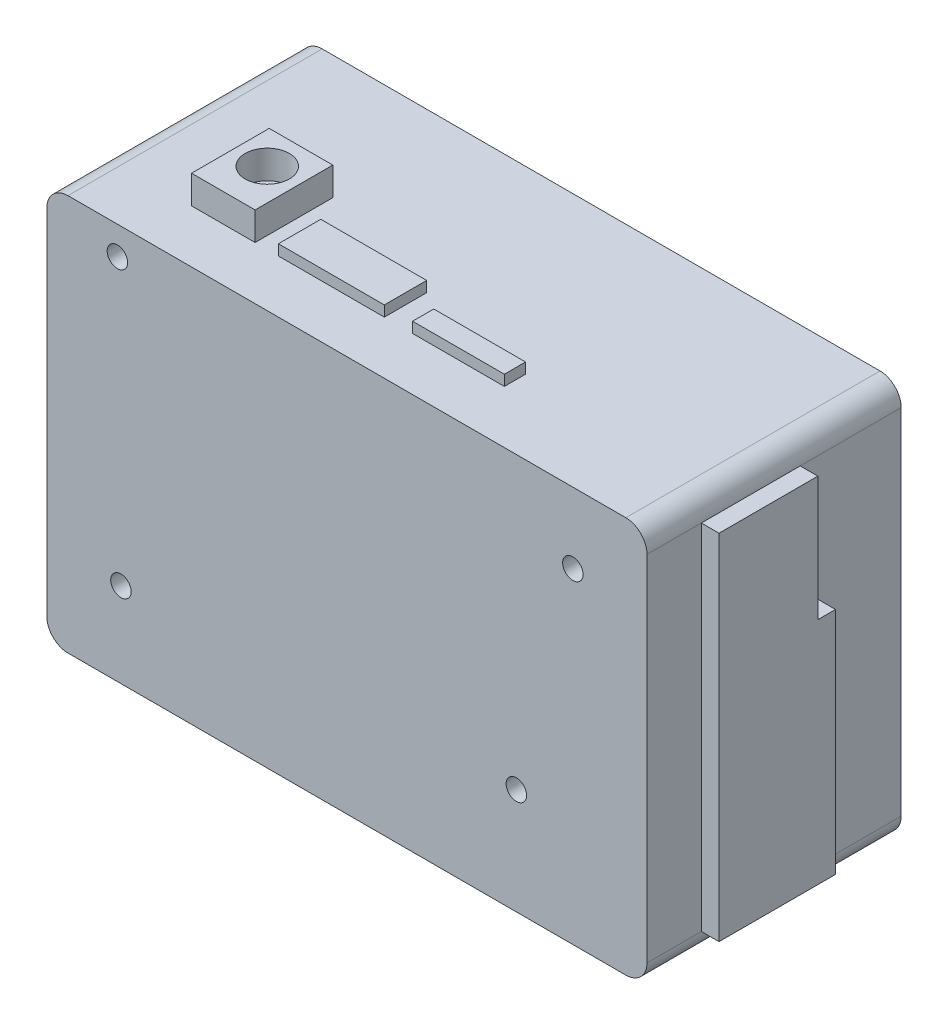
ISO-10303-21;
HEADER;
FILE_DESCRIPTION(('STEP AP214'),'2;1');
FILE_NAME('part.step','',(''),(''),'','','');
FILE_SCHEMA(('AUTOMOTIVE_DESIGN { 1 0 10303 214 1 1 1 1 }'));
ENDSEC;
DATA;
#1=APPLICATION_CONTEXT('core data for automotive mechanical design processes');
#2=APPLICATION_PROTOCOL_DEFINITION('international standard','automotive_design',2000,#1);
#3=PRODUCT_CONTEXT('',#1,'mechanical');
#4=PRODUCT('Part','Part','',(#3));
#5=PRODUCT_RELATED_PRODUCT_CATEGORY('part','',(#4));
#6=PRODUCT_DEFINITION_FORMATION('','',#4);
#7=PRODUCT_DEFINITION_CONTEXT('part definition',#1,'design');
#8=PRODUCT_DEFINITION('design','',#6,#7);
#9=PRODUCT_DEFINITION_SHAPE('','',#8);
#10=(LENGTH_UNIT() NAMED_UNIT(*) SI_UNIT(.MILLI.,.METRE.));
#11=(NAMED_UNIT(*) PLANE_ANGLE_UNIT() SI_UNIT($,.RADIAN.));
#12=(NAMED_UNIT(*) SI_UNIT($,.STERADIAN.) SOLID_ANGLE_UNIT());
#13=UNCERTAINTY_MEASURE_WITH_UNIT(LENGTH_MEASURE(1.E-05),#10,'distance_accuracy_value','');
#14=(GEOMETRIC_REPRESENTATION_CONTEXT(3) GLOBAL_UNCERTAINTY_ASSIGNED_CONTEXT((#13)) GLOBAL_UNIT_ASSIGNED_CONTEXT((#10,
#11,#12)) REPRESENTATION_CONTEXT('',''));
#15=CARTESIAN_POINT('',(0.,0.,0.));
#16=DIRECTION('',(0.,0.,1.));
#17=DIRECTION('',(1.,0.,0.));
#18=AXIS2_PLACEMENT_3D('',#15,#16,#17);
#19=CARTESIAN_POINT('',(42.5,28.05,36.));
#20=DIRECTION('',(0.,-1.,0.));
#21=DIRECTION('',(1.,0.,0.));
#22=AXIS2_PLACEMENT_3D('',#19,#20,#21);
#23=PLANE('',#22);
#24=DIRECTION('',(0.,0.,1.));
#25=VECTOR('',#24,1.);
#26=CARTESIAN_POINT('',(-17.2,28.05,22.5));
#27=LINE('',#26,#25);
#28=CARTESIAN_POINT('',(-17.2,28.05,22.5));
#29=VERTEX_POINT('',#28);
#30=CARTESIAN_POINT('',(-17.2,28.05,28.5));
#31=VERTEX_POINT('',#30);
#32=EDGE_CURVE('E230',#29,#31,#27,.T.);
#33=ORIENTED_EDGE('',*,*,#32,.F.);
#34=DIRECTION('',(-1.,0.,0.));
#35=VECTOR('',#34,1.);
#36=CARTESIAN_POINT('',(-17.2,28.05,22.5));
#37=LINE('',#36,#35);
#38=CARTESIAN_POINT('',(-2.19999999999998,28.05,22.5));
#39=VERTEX_POINT('',#38);
#40=EDGE_CURVE('E243',#39,#29,#37,.T.);
#41=ORIENTED_EDGE('',*,*,#40,.F.);
#42=DIRECTION('',(0.,0.,-1.));
#43=VECTOR('',#42,1.);
#44=CARTESIAN_POINT('',(-2.19999999999997,28.05,22.5));
#45=LINE('',#44,#43);
#46=CARTESIAN_POINT('',(-2.19999999999997,28.05,28.5));
#47=VERTEX_POINT('',#46);
#48=EDGE_CURVE('E252',#47,#39,#45,.T.);
#49=ORIENTED_EDGE('',*,*,#48,.F.);
#50=DIRECTION('',(1.,0.,0.));
#51=VECTOR('',#50,1.);
#52=CARTESIAN_POINT('',(-17.2,28.05,28.5));
#53=LINE('',#52,#51);
#54=EDGE_CURVE('E233',#31,#47,#53,.T.);
#55=ORIENTED_EDGE('',*,*,#54,.F.);
#56=EDGE_LOOP('',(#33,#41,#49,#55));
#57=FACE_BOUND('',#56,.T.);
#58=DIRECTION('',(0.,0.,1.));
#59=VECTOR('',#58,1.);
#60=CARTESIAN_POINT('',(-29.5,28.05,17.5));
#61=LINE('',#60,#59);
#62=CARTESIAN_POINT('',(-29.5,28.05,17.5));
#63=VERTEX_POINT('',#62);
#64=CARTESIAN_POINT('',(-29.5,28.05,28.5));
#65=VERTEX_POINT('',#64);
#66=EDGE_CURVE('E272',#63,#65,#61,.T.);
#67=ORIENTED_EDGE('',*,*,#66,.F.);
#68=DIRECTION('',(-1.,0.,0.));
#69=VECTOR('',#68,1.);
#70=CARTESIAN_POINT('',(-29.5,28.05,17.5));
#71=LINE('',#70,#69);
#72=CARTESIAN_POINT('',(-20.5,28.05,17.5));
#73=VERTEX_POINT('',#72);
#74=EDGE_CURVE('E279',#73,#63,#71,.T.);
#75=ORIENTED_EDGE('',*,*,#74,.F.);
#76=DIRECTION('',(0.,0.,-1.));
#77=VECTOR('',#76,1.);
#78=CARTESIAN_POINT('',(-20.5,28.05,17.5));
#79=LINE('',#78,#77);
#80=CARTESIAN_POINT('',(-20.5,28.05,28.5));
#81=VERTEX_POINT('',#80);
#82=EDGE_CURVE('E291',#81,#73,#79,.T.);
#83=ORIENTED_EDGE('',*,*,#82,.F.);
#84=DIRECTION('',(1.,0.,0.));
#85=VECTOR('',#84,1.);
#86=CARTESIAN_POINT('',(-29.5,28.05,28.5));
#87=LINE('',#86,#85);
#88=EDGE_CURVE('E288',#65,#81,#87,.T.);
#89=ORIENTED_EDGE('',*,*,#88,.F.);
#90=EDGE_LOOP('',(#67,#75,#83,#89));
#91=FACE_BOUND('',#90,.T.);
#92=DIRECTION('',(-1.,0.,0.));
#93=VECTOR('',#92,1.);
#94=CARTESIAN_POINT('',(42.5,28.05,36.));
#95=LINE('',#94,#93);
#96=CARTESIAN_POINT('',(39.5,28.05,36.));
#97=VERTEX_POINT('',#96);
#98=CARTESIAN_POINT('',(-39.5,28.05,36.));
#99=VERTEX_POINT('',#98);
#100=EDGE_CURVE('E388',#97,#99,#95,.T.);
#101=ORIENTED_EDGE('',*,*,#100,.F.);
#102=DIRECTION('',(0.,0.,-1.));
#103=VECTOR('',#102,1.);
#104=CARTESIAN_POINT('',(39.5,28.05,36.));
#105=LINE('',#104,#103);
#106=CARTESIAN_POINT('',(39.5,28.05,0.));
#107=VERTEX_POINT('',#106);
#108=EDGE_CURVE('E403',#97,#107,#105,.T.);
#109=ORIENTED_EDGE('',*,*,#108,.T.);
#110=DIRECTION('',(-1.,0.,0.));
#111=VECTOR('',#110,1.);
#112=CARTESIAN_POINT('',(42.5,28.05,0.));
#113=LINE('',#112,#111);
#114=CARTESIAN_POINT('',(-39.5,28.05,0.));
#115=VERTEX_POINT('',#114);
#116=EDGE_CURVE('E382',#107,#115,#113,.T.);
#117=ORIENTED_EDGE('',*,*,#116,.T.);
#118=DIRECTION('',(0.,0.,-1.));
#119=VECTOR('',#118,1.);
#120=CARTESIAN_POINT('',(-39.5,28.05,36.));
#121=LINE('',#120,#119);
#122=EDGE_CURVE('E391',#115,#99,#121,.F.);
#123=ORIENTED_EDGE('',*,*,#122,.T.);
#124=EDGE_LOOP('',(#101,#109,#117,#123));
#125=FACE_BOUND('',#124,.T.);
#126=DIRECTION('',(0.,0.,1.));
#127=VECTOR('',#126,1.);
#128=CARTESIAN_POINT('',(1.80000000000003,28.05,25.5));
#129=LINE('',#128,#127);
#130=CARTESIAN_POINT('',(1.80000000000003,28.05,25.5));
#131=VERTEX_POINT('',#130);
#132=CARTESIAN_POINT('',(1.80000000000002,28.05,28.5));
#133=VERTEX_POINT('',#132);
#134=EDGE_CURVE('E229',#131,#133,#129,.T.);
#135=ORIENTED_EDGE('',*,*,#134,.F.);
#136=DIRECTION('',(-1.,0.,0.));
#137=VECTOR('',#136,1.);
#138=CARTESIAN_POINT('',(1.80000000000003,28.05,25.5));
#139=LINE('',#138,#137);
#140=CARTESIAN_POINT('',(14.8,28.05,25.5));
#141=VERTEX_POINT('',#140);
#142=EDGE_CURVE('E226',#141,#131,#139,.T.);
#143=ORIENTED_EDGE('',*,*,#142,.F.);
#144=DIRECTION('',(0.,0.,-1.));
#145=VECTOR('',#144,1.);
#146=CARTESIAN_POINT('',(14.8,28.05,25.5));
#147=LINE('',#146,#145);
#148=CARTESIAN_POINT('',(14.8,28.05,28.5));
#149=VERTEX_POINT('',#148);
#150=EDGE_CURVE('E57',#149,#141,#147,.T.);
#151=ORIENTED_EDGE('',*,*,#150,.F.);
#152=DIRECTION('',(1.,0.,0.));
#153=VECTOR('',#152,1.);
#154=CARTESIAN_POINT('',(1.80000000000003,28.05,28.5));
#155=LINE('',#154,#153);
#156=EDGE_CURVE('E52',#133,#149,#155,.T.);
#157=ORIENTED_EDGE('',*,*,#156,.F.);
#158=EDGE_LOOP('',(#135,#143,#151,#157));
#159=FACE_BOUND('',#158,.T.);
#160=ADVANCED_FACE('F36',(#57,#91,#125,#159),#23,.F.);
#161=CARTESIAN_POINT('',(-32.5,24.05,36.));
#162=DIRECTION('',(0.,0.,-1.));
#163=DIRECTION('',(-1.,0.,0.));
#164=AXIS2_PLACEMENT_3D('',#161,#162,#163);
#165=CYLINDRICAL_SURFACE('',#164,1.45);
#166=CARTESIAN_POINT('',(-32.5,24.05,36.));
#167=DIRECTION('',(0.,0.,1.));
#168=DIRECTION('',(1.,0.,0.));
#169=AXIS2_PLACEMENT_3D('',#166,#167,#168);
#170=CIRCLE('',#169,1.45);
#171=CARTESIAN_POINT('',(-31.05,24.05,36.));
#172=VERTEX_POINT('',#171);
#173=EDGE_CURVE('E374',#172,#172,#170,.T.);
#174=ORIENTED_EDGE('',*,*,#173,.T.);
#175=EDGE_LOOP('',(#174));
#176=FACE_BOUND('',#175,.T.);
#177=CARTESIAN_POINT('',(-32.5,24.05,2.5));
#178=DIRECTION('',(0.,0.,-1.));
#179=DIRECTION('',(-1.,0.,0.));
#180=AXIS2_PLACEMENT_3D('',#177,#178,#179);
#181=CIRCLE('',#180,1.45);
#182=CARTESIAN_POINT('',(-33.95,24.05,2.5));
#183=VERTEX_POINT('',#182);
#184=EDGE_CURVE('E313',#183,#183,#181,.T.);
#185=ORIENTED_EDGE('',*,*,#184,.T.);
#186=EDGE_LOOP('',(#185));
#187=FACE_BOUND('',#186,.T.);
#188=ADVANCED_FACE('F504',(#176,#187),#165,.F.);
#189=CARTESIAN_POINT('',(-32.,-16.05,36.));
#190=DIRECTION('',(0.,0.,-1.));
#191=DIRECTION('',(-1.,0.,0.));
#192=AXIS2_PLACEMENT_3D('',#189,#190,#191);
#193=CYLINDRICAL_SURFACE('',#192,1.45);
#194=CARTESIAN_POINT('',(-32.,-16.05,36.));
#195=DIRECTION('',(0.,0.,1.));
#196=DIRECTION('',(1.,0.,0.));
#197=AXIS2_PLACEMENT_3D('',#194,#195,#196);
#198=CIRCLE('',#197,1.45);
#199=CARTESIAN_POINT('',(-30.55,-16.05,36.));
#200=VERTEX_POINT('',#199);
#201=EDGE_CURVE('E371',#200,#200,#198,.T.);
#202=ORIENTED_EDGE('',*,*,#201,.T.);
#203=EDGE_LOOP('',(#202));
#204=FACE_BOUND('',#203,.T.);
#205=CARTESIAN_POINT('',(-32.,-16.05,2.5));
#206=DIRECTION('',(0.,0.,-1.));
#207=DIRECTION('',(-1.,0.,0.));
#208=AXIS2_PLACEMENT_3D('',#205,#206,#207);
#209=CIRCLE('',#208,1.45);
#210=CARTESIAN_POINT('',(-33.45,-16.05,2.5));
#211=VERTEX_POINT('',#210);
#212=EDGE_CURVE('E310',#211,#211,#209,.T.);
#213=ORIENTED_EDGE('',*,*,#212,.T.);
#214=EDGE_LOOP('',(#213));
#215=FACE_BOUND('',#214,.T.);
#216=ADVANCED_FACE('F511',(#204,#215),#193,.F.);
#217=CARTESIAN_POINT('',(32.,18.05,36.));
#218=DIRECTION('',(0.,0.,-1.));
#219=DIRECTION('',(-1.,0.,0.));
#220=AXIS2_PLACEMENT_3D('',#217,#218,#219);
#221=CYLINDRICAL_SURFACE('',#220,1.45);
#222=CARTESIAN_POINT('',(32.,18.05,36.));
#223=DIRECTION('',(0.,0.,1.));
#224=DIRECTION('',(1.,0.,0.));
#225=AXIS2_PLACEMENT_3D('',#222,#223,#224);
#226=CIRCLE('',#225,1.45);
#227=CARTESIAN_POINT('',(33.45,18.05,36.));
#228=VERTEX_POINT('',#227);
#229=EDGE_CURVE('E368',#228,#228,#226,.T.);
#230=ORIENTED_EDGE('',*,*,#229,.T.);
#231=EDGE_LOOP('',(#230));
#232=FACE_BOUND('',#231,.T.);
#233=CARTESIAN_POINT('',(32.,18.05,2.5));
#234=DIRECTION('',(0.,0.,-1.));
#235=DIRECTION('',(-1.,0.,0.));
#236=AXIS2_PLACEMENT_3D('',#233,#234,#235);
#237=CIRCLE('',#236,1.45);
#238=CARTESIAN_POINT('',(30.55,18.05,2.5));
#239=VERTEX_POINT('',#238);
#240=EDGE_CURVE('E307',#239,#239,#237,.T.);
#241=ORIENTED_EDGE('',*,*,#240,.T.);
#242=EDGE_LOOP('',(#241));
#243=FACE_BOUND('',#242,.T.);
#244=ADVANCED_FACE('F583',(#232,#243),#221,.F.);
#245=CARTESIAN_POINT('',(24.,-13.05,36.));
#246=DIRECTION('',(0.,0.,-1.));
#247=DIRECTION('',(-1.,0.,0.));
#248=AXIS2_PLACEMENT_3D('',#245,#246,#247);
#249=CYLINDRICAL_SURFACE('',#248,1.45);
#250=CARTESIAN_POINT('',(24.,-13.05,36.));
#251=DIRECTION('',(0.,0.,1.));
#252=DIRECTION('',(1.,0.,0.));
#253=AXIS2_PLACEMENT_3D('',#250,#251,#252);
#254=CIRCLE('',#253,1.45);
#255=CARTESIAN_POINT('',(25.45,-13.05,36.));
#256=VERTEX_POINT('',#255);
#257=EDGE_CURVE('E365',#256,#256,#254,.T.);
#258=ORIENTED_EDGE('',*,*,#257,.T.);
#259=EDGE_LOOP('',(#258));
#260=FACE_BOUND('',#259,.T.);
#261=CARTESIAN_POINT('',(24.,-13.05,2.5));
#262=DIRECTION('',(0.,0.,-1.));
#263=DIRECTION('',(-1.,0.,0.));
#264=AXIS2_PLACEMENT_3D('',#261,#262,#263);
#265=CIRCLE('',#264,1.45);
#266=CARTESIAN_POINT('',(22.55,-13.05,2.5));
#267=VERTEX_POINT('',#266);
#268=EDGE_CURVE('E40',#267,#267,#265,.T.);
#269=ORIENTED_EDGE('',*,*,#268,.T.);
#270=EDGE_LOOP('',(#269));
#271=FACE_BOUND('',#270,.T.);
#272=ADVANCED_FACE('F580',(#260,#271),#249,.F.);
#273=CARTESIAN_POINT('',(42.5,-28.05,36.));
#274=DIRECTION('',(-1.,0.,0.));
#275=DIRECTION('',(0.,0.,1.));
#276=AXIS2_PLACEMENT_3D('',#273,#274,#275);
#277=PLANE('',#276);
#278=DIRECTION('',(0.,-1.,0.));
#279=VECTOR('',#278,1.);
#280=CARTESIAN_POINT('',(42.5,0.,28.3));
#281=LINE('',#280,#279);
#282=CARTESIAN_POINT('',(42.5,25.05,28.3));
#283=VERTEX_POINT('',#282);
#284=CARTESIAN_POINT('',(42.5,-25.05,28.3));
#285=VERTEX_POINT('',#284);
#286=EDGE_CURVE('E335',#283,#285,#281,.T.);
#287=ORIENTED_EDGE('',*,*,#286,.F.);
#288=DIRECTION('',(0.,0.,-1.));
#289=VECTOR('',#288,1.);
#290=CARTESIAN_POINT('',(42.5,25.05,36.));
#291=LINE('',#290,#289);
#292=CARTESIAN_POINT('',(42.5,25.05,36.));
#293=VERTEX_POINT('',#292);
#294=EDGE_CURVE('E418',#283,#293,#291,.F.);
#295=ORIENTED_EDGE('',*,*,#294,.T.);
#296=DIRECTION('',(0.,1.,0.));
#297=VECTOR('',#296,1.);
#298=CARTESIAN_POINT('',(42.5,-28.05,36.));
#299=LINE('',#298,#297);
#300=CARTESIAN_POINT('',(42.5,-25.05,36.));
#301=VERTEX_POINT('',#300);
#302=EDGE_CURVE('E385',#301,#293,#299,.T.);
#303=ORIENTED_EDGE('',*,*,#302,.F.);
#304=DIRECTION('',(0.,0.,-1.));
#305=VECTOR('',#304,1.);
#306=CARTESIAN_POINT('',(42.5,-25.05,36.));
#307=LINE('',#306,#305);
#308=EDGE_CURVE('E415',#301,#285,#307,.T.);
#309=ORIENTED_EDGE('',*,*,#308,.T.);
#310=EDGE_LOOP('',(#287,#295,#303,#309));
#311=FACE_BOUND('',#310,.T.);
#312=ADVANCED_FACE('F466',(#311),#277,.F.);
#313=DIRECTION('',(0.,1.,0.));
#314=VECTOR('',#313,1.);
#315=CARTESIAN_POINT('',(42.5,0.,11.8));
#316=LINE('',#315,#314);
#317=CARTESIAN_POINT('',(42.5,-25.05,11.8));
#318=VERTEX_POINT('',#317);
#319=CARTESIAN_POINT('',(42.5,7.44999999999999,11.8));
#320=VERTEX_POINT('',#319);
#321=EDGE_CURVE('E341',#318,#320,#316,.T.);
#322=ORIENTED_EDGE('',*,*,#321,.F.);
#323=CARTESIAN_POINT('',(42.5,-25.05,0.));
#324=VERTEX_POINT('',#323);
#325=EDGE_CURVE('E414',#318,#324,#307,.T.);
#326=ORIENTED_EDGE('',*,*,#325,.T.);
#327=DIRECTION('',(0.,1.,0.));
#328=VECTOR('',#327,1.);
#329=CARTESIAN_POINT('',(42.5,-28.05,0.));
#330=LINE('',#329,#328);
#331=CARTESIAN_POINT('',(42.5,25.05,0.));
#332=VERTEX_POINT('',#331);
#333=EDGE_CURVE('E397',#324,#332,#330,.T.);
#334=ORIENTED_EDGE('',*,*,#333,.T.);
#335=CARTESIAN_POINT('',(42.5,25.05,14.3));
#336=VERTEX_POINT('',#335);
#337=EDGE_CURVE('E419',#332,#336,#291,.F.);
#338=ORIENTED_EDGE('',*,*,#337,.T.);
#339=DIRECTION('',(0.,-1.,0.));
#340=VECTOR('',#339,1.);
#341=CARTESIAN_POINT('',(42.5,0.,14.3));
#342=LINE('',#341,#340);
#343=CARTESIAN_POINT('',(42.5,7.44999999999999,14.3));
#344=VERTEX_POINT('',#343);
#345=EDGE_CURVE('E321',#336,#344,#342,.T.);
#346=ORIENTED_EDGE('',*,*,#345,.T.);
#347=DIRECTION('',(0.,0.,1.));
#348=VECTOR('',#347,1.);
#349=CARTESIAN_POINT('',(42.5,7.44999999999999,0.));
#350=LINE('',#349,#348);
#351=EDGE_CURVE('E344',#320,#344,#350,.T.);
#352=ORIENTED_EDGE('',*,*,#351,.F.);
#353=EDGE_LOOP('',(#322,#326,#334,#338,#346,#352));
#354=FACE_BOUND('',#353,.T.);
#355=ADVANCED_FACE('F491',(#354),#277,.F.);
#356=CARTESIAN_POINT('',(0.,0.,36.));
#357=DIRECTION('',(0.,0.,1.));
#358=DIRECTION('',(1.,0.,0.));
#359=AXIS2_PLACEMENT_3D('',#356,#357,#358);
#360=PLANE('',#359);
#361=ORIENTED_EDGE('',*,*,#229,.F.);
#362=EDGE_LOOP('',(#361));
#363=FACE_BOUND('',#362,.T.);
#364=ORIENTED_EDGE('',*,*,#173,.F.);
#365=EDGE_LOOP('',(#364));
#366=FACE_BOUND('',#365,.T.);
#367=ORIENTED_EDGE('',*,*,#302,.T.);
#368=CARTESIAN_POINT('',(39.5,25.05,36.));
#369=DIRECTION('',(0.,0.,1.));
#370=DIRECTION('',(1.,0.,0.));
#371=AXIS2_PLACEMENT_3D('',#368,#369,#370);
#372=CIRCLE('',#371,3.);
#373=EDGE_CURVE('E428',#293,#97,#372,.T.);
#374=ORIENTED_EDGE('',*,*,#373,.T.);
#375=ORIENTED_EDGE('',*,*,#100,.T.);
#376=CARTESIAN_POINT('',(-39.5,25.05,36.));
#377=DIRECTION('',(0.,0.,1.));
#378=DIRECTION('',(1.,0.,0.));
#379=AXIS2_PLACEMENT_3D('',#376,#377,#378);
#380=CIRCLE('',#379,3.);
#381=CARTESIAN_POINT('',(-42.5,25.05,36.));
#382=VERTEX_POINT('',#381);
#383=EDGE_CURVE('E422',#99,#382,#380,.T.);
#384=ORIENTED_EDGE('',*,*,#383,.T.);
#385=DIRECTION('',(0.,-1.,0.));
#386=VECTOR('',#385,1.);
#387=CARTESIAN_POINT('',(-42.5,-28.05,36.));
#388=LINE('',#387,#386);
#389=CARTESIAN_POINT('',(-42.5,-25.05,36.));
#390=VERTEX_POINT('',#389);
#391=EDGE_CURVE('E378',#382,#390,#388,.T.);
#392=ORIENTED_EDGE('',*,*,#391,.T.);
#393=CARTESIAN_POINT('',(-39.5,-25.05,36.));
#394=DIRECTION('',(0.,0.,1.));
#395=DIRECTION('',(1.,0.,0.));
#396=AXIS2_PLACEMENT_3D('',#393,#394,#395);
#397=CIRCLE('',#396,3.);
#398=CARTESIAN_POINT('',(-39.5,-28.05,36.));
#399=VERTEX_POINT('',#398);
#400=EDGE_CURVE('E424',#390,#399,#397,.T.);
#401=ORIENTED_EDGE('',*,*,#400,.T.);
#402=DIRECTION('',(1.,0.,0.));
#403=VECTOR('',#402,1.);
#404=CARTESIAN_POINT('',(42.5,-28.05,36.));
#405=LINE('',#404,#403);
#406=CARTESIAN_POINT('',(39.5,-28.05,36.));
#407=VERTEX_POINT('',#406);
#408=EDGE_CURVE('E381',#399,#407,#405,.T.);
#409=ORIENTED_EDGE('',*,*,#408,.T.);
#410=CARTESIAN_POINT('',(39.5,-25.05,36.));
#411=DIRECTION('',(0.,0.,1.));
#412=DIRECTION('',(1.,0.,0.));
#413=AXIS2_PLACEMENT_3D('',#410,#411,#412);
#414=CIRCLE('',#413,3.);
#415=EDGE_CURVE('E426',#407,#301,#414,.T.);
#416=ORIENTED_EDGE('',*,*,#415,.T.);
#417=EDGE_LOOP('',(#367,#374,#375,#384,#392,#401,#409,#416));
#418=FACE_BOUND('',#417,.T.);
#419=ORIENTED_EDGE('',*,*,#201,.F.);
#420=EDGE_LOOP('',(#419));
#421=FACE_BOUND('',#420,.T.);
#422=ORIENTED_EDGE('',*,*,#257,.F.);
#423=EDGE_LOOP('',(#422));
#424=FACE_BOUND('',#423,.T.);
#425=ADVANCED_FACE('F458',(#363,#366,#418,#421,#424),#360,.T.);
#426=CARTESIAN_POINT('',(0.,0.,0.));
#427=DIRECTION('',(0.,0.,1.));
#428=DIRECTION('',(1.,0.,0.));
#429=AXIS2_PLACEMENT_3D('',#426,#427,#428);
#430=PLANE('',#429);
#431=ORIENTED_EDGE('',*,*,#116,.F.);
#432=CARTESIAN_POINT('',(39.5,25.05,0.));
#433=DIRECTION('',(0.,0.,1.));
#434=DIRECTION('',(1.,0.,0.));
#435=AXIS2_PLACEMENT_3D('',#432,#433,#434);
#436=CIRCLE('',#435,3.);
#437=EDGE_CURVE('E412',#107,#332,#436,.F.);
#438=ORIENTED_EDGE('',*,*,#437,.T.);
#439=ORIENTED_EDGE('',*,*,#333,.F.);
#440=CARTESIAN_POINT('',(39.5,-25.05,0.));
#441=DIRECTION('',(0.,0.,1.));
#442=DIRECTION('',(1.,0.,0.));
#443=AXIS2_PLACEMENT_3D('',#440,#441,#442);
#444=CIRCLE('',#443,3.);
#445=CARTESIAN_POINT('',(39.5,-28.05,0.));
#446=VERTEX_POINT('',#445);
#447=EDGE_CURVE('E410',#324,#446,#444,.F.);
#448=ORIENTED_EDGE('',*,*,#447,.T.);
#449=DIRECTION('',(1.,0.,0.));
#450=VECTOR('',#449,1.);
#451=CARTESIAN_POINT('',(42.5,-28.05,0.));
#452=LINE('',#451,#450);
#453=CARTESIAN_POINT('',(-39.5,-28.05,0.));
#454=VERTEX_POINT('',#453);
#455=EDGE_CURVE('E394',#454,#446,#452,.T.);
#456=ORIENTED_EDGE('',*,*,#455,.F.);
#457=CARTESIAN_POINT('',(-39.5,-25.05,0.));
#458=DIRECTION('',(0.,0.,1.));
#459=DIRECTION('',(1.,0.,0.));
#460=AXIS2_PLACEMENT_3D('',#457,#458,#459);
#461=CIRCLE('',#460,3.);
#462=CARTESIAN_POINT('',(-42.5,-25.05,0.));
#463=VERTEX_POINT('',#462);
#464=EDGE_CURVE('E408',#454,#463,#461,.F.);
#465=ORIENTED_EDGE('',*,*,#464,.T.);
#466=DIRECTION('',(0.,-1.,0.));
#467=VECTOR('',#466,1.);
#468=CARTESIAN_POINT('',(-42.5,-28.05,0.));
#469=LINE('',#468,#467);
#470=CARTESIAN_POINT('',(-42.5,25.05,0.));
#471=VERTEX_POINT('',#470);
#472=EDGE_CURVE('E377',#471,#463,#469,.T.);
#473=ORIENTED_EDGE('',*,*,#472,.F.);
#474=CARTESIAN_POINT('',(-39.5,25.05,0.));
#475=DIRECTION('',(0.,0.,1.));
#476=DIRECTION('',(1.,0.,0.));
#477=AXIS2_PLACEMENT_3D('',#474,#475,#476);
#478=CIRCLE('',#477,3.);
#479=EDGE_CURVE('E406',#471,#115,#478,.F.);
#480=ORIENTED_EDGE('',*,*,#479,.T.);
#481=EDGE_LOOP('',(#431,#438,#439,#448,#456,#465,#473,#480));
#482=FACE_BOUND('',#481,.T.);
#483=ADVANCED_FACE('F446',(#482),#430,.F.);
#484=CARTESIAN_POINT('',(-42.5,-28.05,36.));
#485=DIRECTION('',(1.,0.,0.));
#486=DIRECTION('',(0.,0.,-1.));
#487=AXIS2_PLACEMENT_3D('',#484,#485,#486);
#488=PLANE('',#487);
#489=ORIENTED_EDGE('',*,*,#472,.T.);
#490=DIRECTION('',(0.,0.,-1.));
#491=VECTOR('',#490,1.);
#492=CARTESIAN_POINT('',(-42.5,-25.05,36.));
#493=LINE('',#492,#491);
#494=EDGE_CURVE('E11',#463,#390,#493,.F.);
#495=ORIENTED_EDGE('',*,*,#494,.T.);
#496=ORIENTED_EDGE('',*,*,#391,.F.);
#497=DIRECTION('',(0.,0.,-1.));
#498=VECTOR('',#497,1.);
#499=CARTESIAN_POINT('',(-42.5,25.05,36.));
#500=LINE('',#499,#498);
#501=EDGE_CURVE('E45',#382,#471,#500,.T.);
#502=ORIENTED_EDGE('',*,*,#501,.T.);
#503=EDGE_LOOP('',(#489,#495,#496,#502));
#504=FACE_BOUND('',#503,.T.);
#505=ADVANCED_FACE('F440',(#504),#488,.F.);
#506=CARTESIAN_POINT('',(42.5,-28.05,36.));
#507=DIRECTION('',(0.,1.,0.));
#508=DIRECTION('',(-1.,0.,0.));
#509=AXIS2_PLACEMENT_3D('',#506,#507,#508);
#510=PLANE('',#509);
#511=ORIENTED_EDGE('',*,*,#455,.T.);
#512=DIRECTION('',(0.,0.,-1.));
#513=VECTOR('',#512,1.);
#514=CARTESIAN_POINT('',(39.5,-28.05,36.));
#515=LINE('',#514,#513);
#516=EDGE_CURVE('E433',#446,#407,#515,.F.);
#517=ORIENTED_EDGE('',*,*,#516,.T.);
#518=ORIENTED_EDGE('',*,*,#408,.F.);
#519=DIRECTION('',(0.,0.,-1.));
#520=VECTOR('',#519,1.);
#521=CARTESIAN_POINT('',(-39.5,-28.05,36.));
#522=LINE('',#521,#520);
#523=EDGE_CURVE('E430',#399,#454,#522,.T.);
#524=ORIENTED_EDGE('',*,*,#523,.T.);
#525=EDGE_LOOP('',(#511,#517,#518,#524));
#526=FACE_BOUND('',#525,.T.);
#527=ADVANCED_FACE('F454',(#526),#510,.F.);
#528=CARTESIAN_POINT('',(39.5,25.05,36.));
#529=DIRECTION('',(0.,0.,-1.));
#530=DIRECTION('',(-1.,0.,0.));
#531=AXIS2_PLACEMENT_3D('',#528,#529,#530);
#532=CYLINDRICAL_SURFACE('',#531,3.);
#533=ORIENTED_EDGE('',*,*,#373,.F.);
#534=ORIENTED_EDGE('',*,*,#294,.F.);
#535=DIRECTION('',(0.,0.,1.));
#536=VECTOR('',#535,1.);
#537=CARTESIAN_POINT('',(42.5,25.05,0.));
#538=LINE('',#537,#536);
#539=EDGE_CURVE('E316',#336,#283,#538,.T.);
#540=ORIENTED_EDGE('',*,*,#539,.F.);
#541=ORIENTED_EDGE('',*,*,#337,.F.);
#542=ORIENTED_EDGE('',*,*,#437,.F.);
#543=ORIENTED_EDGE('',*,*,#108,.F.);
#544=EDGE_LOOP('',(#533,#534,#540,#541,#542,#543));
#545=FACE_BOUND('',#544,.T.);
#546=ADVANCED_FACE('F488',(#545),#532,.T.);
#547=CARTESIAN_POINT('',(39.5,-25.05,36.));
#548=DIRECTION('',(0.,0.,-1.));
#549=DIRECTION('',(-1.,0.,0.));
#550=AXIS2_PLACEMENT_3D('',#547,#548,#549);
#551=CYLINDRICAL_SURFACE('',#550,3.);
#552=ORIENTED_EDGE('',*,*,#415,.F.);
#553=ORIENTED_EDGE('',*,*,#516,.F.);
#554=ORIENTED_EDGE('',*,*,#447,.F.);
#555=ORIENTED_EDGE('',*,*,#325,.F.);
#556=DIRECTION('',(0.,0.,-1.));
#557=VECTOR('',#556,1.);
#558=CARTESIAN_POINT('',(42.5,-25.05,0.));
#559=LINE('',#558,#557);
#560=EDGE_CURVE('E338',#285,#318,#559,.T.);
#561=ORIENTED_EDGE('',*,*,#560,.F.);
#562=ORIENTED_EDGE('',*,*,#308,.F.);
#563=EDGE_LOOP('',(#552,#553,#554,#555,#561,#562));
#564=FACE_BOUND('',#563,.T.);
#565=ADVANCED_FACE('F463',(#564),#551,.T.);
#566=CARTESIAN_POINT('',(-39.5,-25.05,36.));
#567=DIRECTION('',(0.,0.,-1.));
#568=DIRECTION('',(-1.,0.,0.));
#569=AXIS2_PLACEMENT_3D('',#566,#567,#568);
#570=CYLINDRICAL_SURFACE('',#569,3.);
#571=ORIENTED_EDGE('',*,*,#400,.F.);
#572=ORIENTED_EDGE('',*,*,#494,.F.);
#573=ORIENTED_EDGE('',*,*,#464,.F.);
#574=ORIENTED_EDGE('',*,*,#523,.F.);
#575=EDGE_LOOP('',(#571,#572,#573,#574));
#576=FACE_BOUND('',#575,.T.);
#577=ADVANCED_FACE('F451',(#576),#570,.T.);
#578=CARTESIAN_POINT('',(-39.5,25.05,36.));
#579=DIRECTION('',(0.,0.,-1.));
#580=DIRECTION('',(-1.,0.,0.));
#581=AXIS2_PLACEMENT_3D('',#578,#579,#580);
#582=CYLINDRICAL_SURFACE('',#581,3.);
#583=ORIENTED_EDGE('',*,*,#383,.F.);
#584=ORIENTED_EDGE('',*,*,#122,.F.);
#585=ORIENTED_EDGE('',*,*,#479,.F.);
#586=ORIENTED_EDGE('',*,*,#501,.F.);
#587=EDGE_LOOP('',(#583,#584,#585,#586));
#588=FACE_BOUND('',#587,.T.);
#589=ADVANCED_FACE('F38',(#588),#582,.T.);
#590=CARTESIAN_POINT('',(45.,25.05,0.));
#591=DIRECTION('',(0.,-1.,0.));
#592=DIRECTION('',(0.,0.,-1.));
#593=AXIS2_PLACEMENT_3D('',#590,#591,#592);
#594=PLANE('',#593);
#595=ORIENTED_EDGE('',*,*,#539,.T.);
#596=DIRECTION('',(-1.,0.,0.));
#597=VECTOR('',#596,1.);
#598=CARTESIAN_POINT('',(45.,25.05,28.3));
#599=LINE('',#598,#597);
#600=CARTESIAN_POINT('',(45.,25.05,28.3));
#601=VERTEX_POINT('',#600);
#602=EDGE_CURVE('E362',#601,#283,#599,.T.);
#603=ORIENTED_EDGE('',*,*,#602,.F.);
#604=DIRECTION('',(0.,0.,1.));
#605=VECTOR('',#604,1.);
#606=CARTESIAN_POINT('',(45.,25.05,0.));
#607=LINE('',#606,#605);
#608=CARTESIAN_POINT('',(45.,25.05,14.3));
#609=VERTEX_POINT('',#608);
#610=EDGE_CURVE('E317',#609,#601,#607,.T.);
#611=ORIENTED_EDGE('',*,*,#610,.F.);
#612=DIRECTION('',(-1.,0.,0.));
#613=VECTOR('',#612,1.);
#614=CARTESIAN_POINT('',(45.,25.05,14.3));
#615=LINE('',#614,#613);
#616=EDGE_CURVE('E332',#609,#336,#615,.T.);
#617=ORIENTED_EDGE('',*,*,#616,.T.);
#618=EDGE_LOOP('',(#595,#603,#611,#617));
#619=FACE_BOUND('',#618,.T.);
#620=ADVANCED_FACE('F483',(#619),#594,.F.);
#621=CARTESIAN_POINT('',(45.,0.,28.3));
#622=DIRECTION('',(0.,0.,-1.));
#623=DIRECTION('',(0.,1.,0.));
#624=AXIS2_PLACEMENT_3D('',#621,#622,#623);
#625=PLANE('',#624);
#626=ORIENTED_EDGE('',*,*,#286,.T.);
#627=DIRECTION('',(-1.,0.,0.));
#628=VECTOR('',#627,1.);
#629=CARTESIAN_POINT('',(45.,-25.05,28.3));
#630=LINE('',#629,#628);
#631=CARTESIAN_POINT('',(45.,-25.05,28.3));
#632=VERTEX_POINT('',#631);
#633=EDGE_CURVE('E359',#632,#285,#630,.T.);
#634=ORIENTED_EDGE('',*,*,#633,.F.);
#635=DIRECTION('',(0.,-1.,0.));
#636=VECTOR('',#635,1.);
#637=CARTESIAN_POINT('',(45.,0.,28.3));
#638=LINE('',#637,#636);
#639=EDGE_CURVE('E320',#601,#632,#638,.T.);
#640=ORIENTED_EDGE('',*,*,#639,.F.);
#641=ORIENTED_EDGE('',*,*,#602,.T.);
#642=EDGE_LOOP('',(#626,#634,#640,#641));
#643=FACE_BOUND('',#642,.T.);
#644=ADVANCED_FACE('F470',(#643),#625,.F.);
#645=CARTESIAN_POINT('',(45.,-25.05,0.));
#646=DIRECTION('',(0.,1.,0.));
#647=DIRECTION('',(0.,0.,1.));
#648=AXIS2_PLACEMENT_3D('',#645,#646,#647);
#649=PLANE('',#648);
#650=ORIENTED_EDGE('',*,*,#560,.T.);
#651=DIRECTION('',(-1.,0.,0.));
#652=VECTOR('',#651,1.);
#653=CARTESIAN_POINT('',(45.,-25.05,11.8));
#654=LINE('',#653,#652);
#655=CARTESIAN_POINT('',(45.,-25.05,11.8));
#656=VERTEX_POINT('',#655);
#657=EDGE_CURVE('E356',#656,#318,#654,.T.);
#658=ORIENTED_EDGE('',*,*,#657,.F.);
#659=DIRECTION('',(0.,0.,-1.));
#660=VECTOR('',#659,1.);
#661=CARTESIAN_POINT('',(45.,-25.05,0.));
#662=LINE('',#661,#660);
#663=EDGE_CURVE('E323',#632,#656,#662,.T.);
#664=ORIENTED_EDGE('',*,*,#663,.F.);
#665=ORIENTED_EDGE('',*,*,#633,.T.);
#666=EDGE_LOOP('',(#650,#658,#664,#665));
#667=FACE_BOUND('',#666,.T.);
#668=ADVANCED_FACE('F474',(#667),#649,.F.);
#669=CARTESIAN_POINT('',(45.,0.,11.8));
#670=DIRECTION('',(0.,0.,1.));
#671=DIRECTION('',(1.,0.,0.));
#672=AXIS2_PLACEMENT_3D('',#669,#670,#671);
#673=PLANE('',#672);
#674=ORIENTED_EDGE('',*,*,#321,.T.);
#675=DIRECTION('',(-1.,0.,0.));
#676=VECTOR('',#675,1.);
#677=CARTESIAN_POINT('',(45.,7.44999999999999,11.8));
#678=LINE('',#677,#676);
#679=CARTESIAN_POINT('',(45.,7.44999999999999,11.8));
#680=VERTEX_POINT('',#679);
#681=EDGE_CURVE('E353',#680,#320,#678,.T.);
#682=ORIENTED_EDGE('',*,*,#681,.F.);
#683=DIRECTION('',(0.,1.,0.));
#684=VECTOR('',#683,1.);
#685=CARTESIAN_POINT('',(45.,0.,11.8));
#686=LINE('',#685,#684);
#687=EDGE_CURVE('E325',#656,#680,#686,.T.);
#688=ORIENTED_EDGE('',*,*,#687,.F.);
#689=ORIENTED_EDGE('',*,*,#657,.T.);
#690=EDGE_LOOP('',(#674,#682,#688,#689));
#691=FACE_BOUND('',#690,.T.);
#692=ADVANCED_FACE('F571',(#691),#673,.F.);
#693=CARTESIAN_POINT('',(45.,7.44999999999999,0.));
#694=DIRECTION('',(0.,-1.,0.));
#695=DIRECTION('',(0.,0.,-1.));
#696=AXIS2_PLACEMENT_3D('',#693,#694,#695);
#697=PLANE('',#696);
#698=ORIENTED_EDGE('',*,*,#351,.T.);
#699=DIRECTION('',(-1.,0.,0.));
#700=VECTOR('',#699,1.);
#701=CARTESIAN_POINT('',(45.,7.44999999999999,14.3));
#702=LINE('',#701,#700);
#703=CARTESIAN_POINT('',(45.,7.44999999999999,14.3));
#704=VERTEX_POINT('',#703);
#705=EDGE_CURVE('E350',#704,#344,#702,.T.);
#706=ORIENTED_EDGE('',*,*,#705,.F.);
#707=DIRECTION('',(0.,0.,1.));
#708=VECTOR('',#707,1.);
#709=CARTESIAN_POINT('',(45.,7.44999999999999,0.));
#710=LINE('',#709,#708);
#711=EDGE_CURVE('E327',#680,#704,#710,.T.);
#712=ORIENTED_EDGE('',*,*,#711,.F.);
#713=ORIENTED_EDGE('',*,*,#681,.T.);
#714=EDGE_LOOP('',(#698,#706,#712,#713));
#715=FACE_BOUND('',#714,.T.);
#716=ADVANCED_FACE('F567',(#715),#697,.F.);
#717=CARTESIAN_POINT('',(45.,0.,14.3));
#718=DIRECTION('',(0.,0.,-1.));
#719=DIRECTION('',(0.,1.,0.));
#720=AXIS2_PLACEMENT_3D('',#717,#718,#719);
#721=PLANE('',#720);
#722=ORIENTED_EDGE('',*,*,#345,.F.);
#723=ORIENTED_EDGE('',*,*,#616,.F.);
#724=DIRECTION('',(0.,-1.,0.));
#725=VECTOR('',#724,1.);
#726=CARTESIAN_POINT('',(45.,0.,14.3));
#727=LINE('',#726,#725);
#728=EDGE_CURVE('E329',#609,#704,#727,.T.);
#729=ORIENTED_EDGE('',*,*,#728,.T.);
#730=ORIENTED_EDGE('',*,*,#705,.T.);
#731=EDGE_LOOP('',(#722,#723,#729,#730));
#732=FACE_BOUND('',#731,.T.);
#733=ADVANCED_FACE('F564',(#732),#721,.T.);
#734=CARTESIAN_POINT('',(45.,0.,0.));
#735=DIRECTION('',(1.,0.,0.));
#736=DIRECTION('',(0.,0.,-1.));
#737=AXIS2_PLACEMENT_3D('',#734,#735,#736);
#738=PLANE('',#737);
#739=ORIENTED_EDGE('',*,*,#610,.T.);
#740=ORIENTED_EDGE('',*,*,#639,.T.);
#741=ORIENTED_EDGE('',*,*,#663,.T.);
#742=ORIENTED_EDGE('',*,*,#687,.T.);
#743=ORIENTED_EDGE('',*,*,#711,.T.);
#744=ORIENTED_EDGE('',*,*,#728,.F.);
#745=EDGE_LOOP('',(#739,#740,#741,#742,#743,#744));
#746=FACE_BOUND('',#745,.T.);
#747=ADVANCED_FACE('F478',(#746),#738,.T.);
#748=CARTESIAN_POINT('',(0.,0.,2.5));
#749=DIRECTION('',(0.,0.,-1.));
#750=DIRECTION('',(-1.,0.,0.));
#751=AXIS2_PLACEMENT_3D('',#748,#749,#750);
#752=PLANE('',#751);
#753=ORIENTED_EDGE('',*,*,#268,.F.);
#754=EDGE_LOOP('',(#753));
#755=FACE_BOUND('',#754,.T.);
#756=ADVANCED_FACE('F561',(#755),#752,.F.);
#757=ORIENTED_EDGE('',*,*,#240,.F.);
#758=EDGE_LOOP('',(#757));
#759=FACE_BOUND('',#758,.T.);
#760=ADVANCED_FACE('F678',(#759),#752,.F.);
#761=ORIENTED_EDGE('',*,*,#212,.F.);
#762=EDGE_LOOP('',(#761));
#763=FACE_BOUND('',#762,.T.);
#764=ADVANCED_FACE('F559',(#763),#752,.F.);
#765=ORIENTED_EDGE('',*,*,#184,.F.);
#766=EDGE_LOOP('',(#765));
#767=FACE_BOUND('',#766,.T.);
#768=ADVANCED_FACE('F544',(#767),#752,.F.);
#769=CARTESIAN_POINT('',(0.,32.05,0.));
#770=DIRECTION('',(0.,1.,0.));
#771=DIRECTION('',(-1.,0.,0.));
#772=AXIS2_PLACEMENT_3D('',#769,#770,#771);
#773=PLANE('',#772);
#774=DIRECTION('',(0.,0.,1.));
#775=VECTOR('',#774,1.);
#776=CARTESIAN_POINT('',(-29.5,32.05,17.5));
#777=LINE('',#776,#775);
#778=CARTESIAN_POINT('',(-29.5,32.05,17.5));
#779=VERTEX_POINT('',#778);
#780=CARTESIAN_POINT('',(-29.5,32.05,28.5));
#781=VERTEX_POINT('',#780);
#782=EDGE_CURVE('E275',#779,#781,#777,.T.);
#783=ORIENTED_EDGE('',*,*,#782,.T.);
#784=DIRECTION('',(1.,0.,0.));
#785=VECTOR('',#784,1.);
#786=CARTESIAN_POINT('',(-29.5,32.05,28.5));
#787=LINE('',#786,#785);
#788=CARTESIAN_POINT('',(-20.5,32.05,28.5));
#789=VERTEX_POINT('',#788);
#790=EDGE_CURVE('E278',#781,#789,#787,.T.);
#791=ORIENTED_EDGE('',*,*,#790,.T.);
#792=DIRECTION('',(0.,0.,-1.));
#793=VECTOR('',#792,1.);
#794=CARTESIAN_POINT('',(-20.5,32.05,17.5));
#795=LINE('',#794,#793);
#796=CARTESIAN_POINT('',(-20.5,32.05,17.5));
#797=VERTEX_POINT('',#796);
#798=EDGE_CURVE('E281',#789,#797,#795,.T.);
#799=ORIENTED_EDGE('',*,*,#798,.T.);
#800=DIRECTION('',(-1.,0.,0.));
#801=VECTOR('',#800,1.);
#802=CARTESIAN_POINT('',(-29.5,32.05,17.5));
#803=LINE('',#802,#801);
#804=EDGE_CURVE('E283',#797,#779,#803,.T.);
#805=ORIENTED_EDGE('',*,*,#804,.T.);
#806=EDGE_LOOP('',(#783,#791,#799,#805));
#807=FACE_BOUND('',#806,.T.);
#808=CARTESIAN_POINT('',(-25.,32.05,22.2803229141812));
#809=DIRECTION('',(0.,1.,0.));
#810=DIRECTION('',(-1.,0.,0.));
#811=AXIS2_PLACEMENT_3D('',#808,#809,#810);
#812=CIRCLE('',#811,3.13369894550735);
#813=CARTESIAN_POINT('',(-28.1336989455073,32.05,22.2803229141812));
#814=VERTEX_POINT('',#813);
#815=EDGE_CURVE('E269',#814,#814,#812,.T.);
#816=ORIENTED_EDGE('',*,*,#815,.F.);
#817=EDGE_LOOP('',(#816));
#818=FACE_BOUND('',#817,.T.);
#819=ADVANCED_FACE('F541',(#807,#818),#773,.T.);
#820=CARTESIAN_POINT('',(-29.5,32.05,17.5));
#821=DIRECTION('',(1.,0.,0.));
#822=DIRECTION('',(0.,1.,0.));
#823=AXIS2_PLACEMENT_3D('',#820,#821,#822);
#824=PLANE('',#823);
#825=ORIENTED_EDGE('',*,*,#66,.T.);
#826=DIRECTION('',(0.,-1.,0.));
#827=VECTOR('',#826,1.);
#828=CARTESIAN_POINT('',(-29.5,32.05,28.5));
#829=LINE('',#828,#827);
#830=EDGE_CURVE('E304',#781,#65,#829,.T.);
#831=ORIENTED_EDGE('',*,*,#830,.F.);
#832=ORIENTED_EDGE('',*,*,#782,.F.);
#833=DIRECTION('',(0.,-1.,0.));
#834=VECTOR('',#833,1.);
#835=CARTESIAN_POINT('',(-29.5,32.05,17.5));
#836=LINE('',#835,#834);
#837=EDGE_CURVE('E285',#779,#63,#836,.T.);
#838=ORIENTED_EDGE('',*,*,#837,.T.);
#839=EDGE_LOOP('',(#825,#831,#832,#838));
#840=FACE_BOUND('',#839,.T.);
#841=ADVANCED_FACE('F543',(#840),#824,.F.);
#842=CARTESIAN_POINT('',(-29.5,32.05,28.5));
#843=DIRECTION('',(0.,0.,-1.));
#844=DIRECTION('',(-1.,0.,0.));
#845=AXIS2_PLACEMENT_3D('',#842,#843,#844);
#846=PLANE('',#845);
#847=ORIENTED_EDGE('',*,*,#88,.T.);
#848=DIRECTION('',(0.,-1.,0.));
#849=VECTOR('',#848,1.);
#850=CARTESIAN_POINT('',(-20.5,32.05,28.5));
#851=LINE('',#850,#849);
#852=EDGE_CURVE('E301',#789,#81,#851,.T.);
#853=ORIENTED_EDGE('',*,*,#852,.F.);
#854=ORIENTED_EDGE('',*,*,#790,.F.);
#855=ORIENTED_EDGE('',*,*,#830,.T.);
#856=EDGE_LOOP('',(#847,#853,#854,#855));
#857=FACE_BOUND('',#856,.T.);
#858=ADVANCED_FACE('F549',(#857),#846,.F.);
#859=CARTESIAN_POINT('',(-20.5,32.05,17.5));
#860=DIRECTION('',(-1.,0.,0.));
#861=DIRECTION('',(0.,-1.,0.));
#862=AXIS2_PLACEMENT_3D('',#859,#860,#861);
#863=PLANE('',#862);
#864=ORIENTED_EDGE('',*,*,#82,.T.);
#865=DIRECTION('',(0.,-1.,0.));
#866=VECTOR('',#865,1.);
#867=CARTESIAN_POINT('',(-20.5,32.05,17.5));
#868=LINE('',#867,#866);
#869=EDGE_CURVE('E298',#797,#73,#868,.T.);
#870=ORIENTED_EDGE('',*,*,#869,.F.);
#871=ORIENTED_EDGE('',*,*,#798,.F.);
#872=ORIENTED_EDGE('',*,*,#852,.T.);
#873=EDGE_LOOP('',(#864,#870,#871,#872));
#874=FACE_BOUND('',#873,.T.);
#875=ADVANCED_FACE('F536',(#874),#863,.F.);
#876=CARTESIAN_POINT('',(-29.5,32.05,17.5));
#877=DIRECTION('',(0.,0.,1.));
#878=DIRECTION('',(1.,0.,0.));
#879=AXIS2_PLACEMENT_3D('',#876,#877,#878);
#880=PLANE('',#879);
#881=ORIENTED_EDGE('',*,*,#74,.T.);
#882=ORIENTED_EDGE('',*,*,#837,.F.);
#883=ORIENTED_EDGE('',*,*,#804,.F.);
#884=ORIENTED_EDGE('',*,*,#869,.T.);
#885=EDGE_LOOP('',(#881,#882,#883,#884));
#886=FACE_BOUND('',#885,.T.);
#887=ADVANCED_FACE('F528',(#886),#880,.F.);
#888=CARTESIAN_POINT('',(-25.,32.05,22.2803229141812));
#889=DIRECTION('',(0.,-1.,0.));
#890=DIRECTION('',(1.,0.,0.));
#891=AXIS2_PLACEMENT_3D('',#888,#889,#890);
#892=CYLINDRICAL_SURFACE('',#891,3.13369894550735);
#893=ORIENTED_EDGE('',*,*,#815,.T.);
#894=EDGE_LOOP('',(#893));
#895=FACE_BOUND('',#894,.T.);
#896=CARTESIAN_POINT('',(-25.,28.05,22.2803229141812));
#897=DIRECTION('',(0.,1.,0.));
#898=DIRECTION('',(-1.,0.,0.));
#899=AXIS2_PLACEMENT_3D('',#896,#897,#898);
#900=CIRCLE('',#899,3.13369894550735);
#901=CARTESIAN_POINT('',(-28.1336989455073,28.05,22.2803229141812));
#902=VERTEX_POINT('',#901);
#903=EDGE_CURVE('E268',#902,#902,#900,.T.);
#904=ORIENTED_EDGE('',*,*,#903,.F.);
#905=EDGE_LOOP('',(#904));
#906=FACE_BOUND('',#905,.T.);
#907=ADVANCED_FACE('F519',(#895,#906),#892,.F.);
#908=ORIENTED_EDGE('',*,*,#903,.T.);
#909=EDGE_LOOP('',(#908));
#910=FACE_BOUND('',#909,.T.);
#911=ADVANCED_FACE('F507',(#910),#23,.F.);
#912=CARTESIAN_POINT('',(-17.2,29.55,22.5));
#913=DIRECTION('',(1.,0.,0.));
#914=DIRECTION('',(0.,1.,0.));
#915=AXIS2_PLACEMENT_3D('',#912,#913,#914);
#916=PLANE('',#915);
#917=ORIENTED_EDGE('',*,*,#32,.T.);
#918=DIRECTION('',(0.,-1.,0.));
#919=VECTOR('',#918,1.);
#920=CARTESIAN_POINT('',(-17.2,29.55,28.5));
#921=LINE('',#920,#919);
#922=CARTESIAN_POINT('',(-17.2,29.55,28.5));
#923=VERTEX_POINT('',#922);
#924=EDGE_CURVE('E265',#923,#31,#921,.T.);
#925=ORIENTED_EDGE('',*,*,#924,.F.);
#926=DIRECTION('',(0.,0.,1.));
#927=VECTOR('',#926,1.);
#928=CARTESIAN_POINT('',(-17.2,29.55,22.5));
#929=LINE('',#928,#927);
#930=CARTESIAN_POINT('',(-17.2,29.55,22.5));
#931=VERTEX_POINT('',#930);
#932=EDGE_CURVE('E239',#931,#923,#929,.T.);
#933=ORIENTED_EDGE('',*,*,#932,.F.);
#934=DIRECTION('',(0.,-1.,0.));
#935=VECTOR('',#934,1.);
#936=CARTESIAN_POINT('',(-17.2,29.55,22.5));
#937=LINE('',#936,#935);
#938=EDGE_CURVE('E248',#931,#29,#937,.T.);
#939=ORIENTED_EDGE('',*,*,#938,.T.);
#940=EDGE_LOOP('',(#917,#925,#933,#939));
#941=FACE_BOUND('',#940,.T.);
#942=ADVANCED_FACE('F518',(#941),#916,.F.);
#943=CARTESIAN_POINT('',(-17.2,29.55,28.5));
#944=DIRECTION('',(0.,0.,-1.));
#945=DIRECTION('',(-1.,0.,0.));
#946=AXIS2_PLACEMENT_3D('',#943,#944,#945);
#947=PLANE('',#946);
#948=ORIENTED_EDGE('',*,*,#54,.T.);
#949=DIRECTION('',(0.,-1.,0.));
#950=VECTOR('',#949,1.);
#951=CARTESIAN_POINT('',(-2.19999999999997,29.55,28.5));
#952=LINE('',#951,#950);
#953=CARTESIAN_POINT('',(-2.19999999999997,29.55,28.5));
#954=VERTEX_POINT('',#953);
#955=EDGE_CURVE('E262',#954,#47,#952,.T.);
#956=ORIENTED_EDGE('',*,*,#955,.F.);
#957=DIRECTION('',(1.,0.,0.));
#958=VECTOR('',#957,1.);
#959=CARTESIAN_POINT('',(-17.2,29.55,28.5));
#960=LINE('',#959,#958);
#961=EDGE_CURVE('E242',#923,#954,#960,.T.);
#962=ORIENTED_EDGE('',*,*,#961,.F.);
#963=ORIENTED_EDGE('',*,*,#924,.T.);
#964=EDGE_LOOP('',(#948,#956,#962,#963));
#965=FACE_BOUND('',#964,.T.);
#966=ADVANCED_FACE('F525',(#965),#947,.F.);
#967=CARTESIAN_POINT('',(-2.19999999999998,29.55,22.5));
#968=DIRECTION('',(-1.,0.,0.));
#969=DIRECTION('',(0.,-1.,0.));
#970=AXIS2_PLACEMENT_3D('',#967,#968,#969);
#971=PLANE('',#970);
#972=ORIENTED_EDGE('',*,*,#48,.T.);
#973=DIRECTION('',(0.,-1.,0.));
#974=VECTOR('',#973,1.);
#975=CARTESIAN_POINT('',(-2.19999999999998,29.55,22.5));
#976=LINE('',#975,#974);
#977=CARTESIAN_POINT('',(-2.19999999999998,29.55,22.5));
#978=VERTEX_POINT('',#977);
#979=EDGE_CURVE('E259',#978,#39,#976,.T.);
#980=ORIENTED_EDGE('',*,*,#979,.F.);
#981=DIRECTION('',(0.,0.,-1.));
#982=VECTOR('',#981,1.);
#983=CARTESIAN_POINT('',(-2.19999999999998,29.55,22.5));
#984=LINE('',#983,#982);
#985=EDGE_CURVE('E245',#954,#978,#984,.T.);
#986=ORIENTED_EDGE('',*,*,#985,.F.);
#987=ORIENTED_EDGE('',*,*,#955,.T.);
#988=EDGE_LOOP('',(#972,#980,#986,#987));
#989=FACE_BOUND('',#988,.T.);
#990=ADVANCED_FACE('F747',(#989),#971,.F.);
#991=CARTESIAN_POINT('',(-17.2,29.55,22.5));
#992=DIRECTION('',(0.,0.,1.));
#993=DIRECTION('',(1.,0.,0.));
#994=AXIS2_PLACEMENT_3D('',#991,#992,#993);
#995=PLANE('',#994);
#996=ORIENTED_EDGE('',*,*,#40,.T.);
#997=ORIENTED_EDGE('',*,*,#938,.F.);
#998=DIRECTION('',(-1.,0.,0.));
#999=VECTOR('',#998,1.);
#1000=CARTESIAN_POINT('',(-17.2,29.55,22.5));
#1001=LINE('',#1000,#999);
#1002=EDGE_CURVE('E247',#978,#931,#1001,.T.);
#1003=ORIENTED_EDGE('',*,*,#1002,.F.);
#1004=ORIENTED_EDGE('',*,*,#979,.T.);
#1005=EDGE_LOOP('',(#996,#997,#1003,#1004));
#1006=FACE_BOUND('',#1005,.T.);
#1007=ADVANCED_FACE('F755',(#1006),#995,.F.);
#1008=CARTESIAN_POINT('',(0.,29.55,0.));
#1009=DIRECTION('',(0.,1.,0.));
#1010=DIRECTION('',(-1.,0.,0.));
#1011=AXIS2_PLACEMENT_3D('',#1008,#1009,#1010);
#1012=PLANE('',#1011);
#1013=ORIENTED_EDGE('',*,*,#932,.T.);
#1014=ORIENTED_EDGE('',*,*,#961,.T.);
#1015=ORIENTED_EDGE('',*,*,#985,.T.);
#1016=ORIENTED_EDGE('',*,*,#1002,.T.);
#1017=EDGE_LOOP('',(#1013,#1014,#1015,#1016));
#1018=FACE_BOUND('',#1017,.T.);
#1019=ADVANCED_FACE('F764',(#1018),#1012,.T.);
#1020=CARTESIAN_POINT('',(1.80000000000003,29.55,25.5));
#1021=DIRECTION('',(1.,0.,0.));
#1022=DIRECTION('',(0.,1.,0.));
#1023=AXIS2_PLACEMENT_3D('',#1020,#1021,#1022);
#1024=PLANE('',#1023);
#1025=ORIENTED_EDGE('',*,*,#134,.T.);
#1026=DIRECTION('',(0.,-1.,0.));
#1027=VECTOR('',#1026,1.);
#1028=CARTESIAN_POINT('',(1.80000000000003,29.55,28.5));
#1029=LINE('',#1028,#1027);
#1030=CARTESIAN_POINT('',(1.80000000000003,29.55,28.5));
#1031=VERTEX_POINT('',#1030);
#1032=EDGE_CURVE('E210',#1031,#133,#1029,.T.);
#1033=ORIENTED_EDGE('',*,*,#1032,.F.);
#1034=DIRECTION('',(0.,0.,1.));
#1035=VECTOR('',#1034,1.);
#1036=CARTESIAN_POINT('',(1.80000000000003,29.55,25.5));
#1037=LINE('',#1036,#1035);
#1038=CARTESIAN_POINT('',(1.80000000000003,29.55,25.5));
#1039=VERTEX_POINT('',#1038);
#1040=EDGE_CURVE('E217',#1039,#1031,#1037,.T.);
#1041=ORIENTED_EDGE('',*,*,#1040,.F.);
#1042=DIRECTION('',(0.,-1.,0.));
#1043=VECTOR('',#1042,1.);
#1044=CARTESIAN_POINT('',(1.80000000000003,29.55,25.5));
#1045=LINE('',#1044,#1043);
#1046=EDGE_CURVE('E826',#1039,#131,#1045,.T.);
#1047=ORIENTED_EDGE('',*,*,#1046,.T.);
#1048=EDGE_LOOP('',(#1025,#1033,#1041,#1047));
#1049=FACE_BOUND('',#1048,.T.);
#1050=ADVANCED_FACE('F228',(#1049),#1024,.F.);
#1051=CARTESIAN_POINT('',(1.80000000000003,29.55,28.5));
#1052=DIRECTION('',(0.,0.,-1.));
#1053=DIRECTION('',(-1.,0.,0.));
#1054=AXIS2_PLACEMENT_3D('',#1051,#1052,#1053);
#1055=PLANE('',#1054);
#1056=ORIENTED_EDGE('',*,*,#156,.T.);
#1057=DIRECTION('',(0.,-1.,0.));
#1058=VECTOR('',#1057,1.);
#1059=CARTESIAN_POINT('',(14.8,29.55,28.5));
#1060=LINE('',#1059,#1058);
#1061=CARTESIAN_POINT('',(14.8,29.55,28.5));
#1062=VERTEX_POINT('',#1061);
#1063=EDGE_CURVE('E213',#1062,#149,#1060,.T.);
#1064=ORIENTED_EDGE('',*,*,#1063,.F.);
#1065=DIRECTION('',(1.,0.,0.));
#1066=VECTOR('',#1065,1.);
#1067=CARTESIAN_POINT('',(1.80000000000003,29.55,28.5));
#1068=LINE('',#1067,#1066);
#1069=EDGE_CURVE('E206',#1031,#1062,#1068,.T.);
#1070=ORIENTED_EDGE('',*,*,#1069,.F.);
#1071=ORIENTED_EDGE('',*,*,#1032,.T.);
#1072=EDGE_LOOP('',(#1056,#1064,#1070,#1071));
#1073=FACE_BOUND('',#1072,.T.);
#1074=ADVANCED_FACE('F208',(#1073),#1055,.F.);
#1075=CARTESIAN_POINT('',(14.8,29.55,25.5));
#1076=DIRECTION('',(-1.,0.,0.));
#1077=DIRECTION('',(0.,0.,1.));
#1078=AXIS2_PLACEMENT_3D('',#1075,#1076,#1077);
#1079=PLANE('',#1078);
#1080=ORIENTED_EDGE('',*,*,#150,.T.);
#1081=DIRECTION('',(0.,-1.,0.));
#1082=VECTOR('',#1081,1.);
#1083=CARTESIAN_POINT('',(14.8,29.55,25.5));
#1084=LINE('',#1083,#1082);
#1085=CARTESIAN_POINT('',(14.8,29.55,25.5));
#1086=VERTEX_POINT('',#1085);
#1087=EDGE_CURVE('E235',#1086,#141,#1084,.T.);
#1088=ORIENTED_EDGE('',*,*,#1087,.F.);
#1089=DIRECTION('',(0.,0.,-1.));
#1090=VECTOR('',#1089,1.);
#1091=CARTESIAN_POINT('',(14.8,29.55,25.5));
#1092=LINE('',#1091,#1090);
#1093=EDGE_CURVE('E216',#1062,#1086,#1092,.T.);
#1094=ORIENTED_EDGE('',*,*,#1093,.F.);
#1095=ORIENTED_EDGE('',*,*,#1063,.T.);
#1096=EDGE_LOOP('',(#1080,#1088,#1094,#1095));
#1097=FACE_BOUND('',#1096,.T.);
#1098=ADVANCED_FACE('F788',(#1097),#1079,.F.);
#1099=CARTESIAN_POINT('',(1.80000000000003,29.55,25.5));
#1100=DIRECTION('',(0.,0.,1.));
#1101=DIRECTION('',(1.,0.,0.));
#1102=AXIS2_PLACEMENT_3D('',#1099,#1100,#1101);
#1103=PLANE('',#1102);
#1104=ORIENTED_EDGE('',*,*,#142,.T.);
#1105=ORIENTED_EDGE('',*,*,#1046,.F.);
#1106=DIRECTION('',(-1.,0.,0.));
#1107=VECTOR('',#1106,1.);
#1108=CARTESIAN_POINT('',(1.80000000000003,29.55,25.5));
#1109=LINE('',#1108,#1107);
#1110=EDGE_CURVE('E222',#1086,#1039,#1109,.T.);
#1111=ORIENTED_EDGE('',*,*,#1110,.F.);
#1112=ORIENTED_EDGE('',*,*,#1087,.T.);
#1113=EDGE_LOOP('',(#1104,#1105,#1111,#1112));
#1114=FACE_BOUND('',#1113,.T.);
#1115=ADVANCED_FACE('F796',(#1114),#1103,.F.);
#1116=CARTESIAN_POINT('',(0.,29.55,0.));
#1117=DIRECTION('',(0.,1.,0.));
#1118=DIRECTION('',(-1.,0.,0.));
#1119=AXIS2_PLACEMENT_3D('',#1116,#1117,#1118);
#1120=PLANE('',#1119);
#1121=ORIENTED_EDGE('',*,*,#1040,.T.);
#1122=ORIENTED_EDGE('',*,*,#1069,.T.);
#1123=ORIENTED_EDGE('',*,*,#1093,.T.);
#1124=ORIENTED_EDGE('',*,*,#1110,.T.);
#1125=EDGE_LOOP('',(#1121,#1122,#1123,#1124));
#1126=FACE_BOUND('',#1125,.T.);
#1127=ADVANCED_FACE('F220',(#1126),#1120,.T.);
#1128=CLOSED_SHELL('',(#160,#188,#216,#244,#272,#312,#355,#425,#483,#505,#527,#546,#565,#577,
#589,#620,#644,#668,#692,#716,#733,#747,#756,#760,#764,#768,#819,#841,#858,#875,#887,#907,#911,
#942,#966,#990,#1007,#1019,#1050,#1074,#1098,#1115,#1127));
#1129=MANIFOLD_SOLID_BREP('B2',#1128);
#1130=ADVANCED_BREP_SHAPE_REPRESENTATION('',(#18,#1129),#14);
#1131=SHAPE_DEFINITION_REPRESENTATION(#9,#1130);
ENDSEC;
END-ISO-10303-21;
